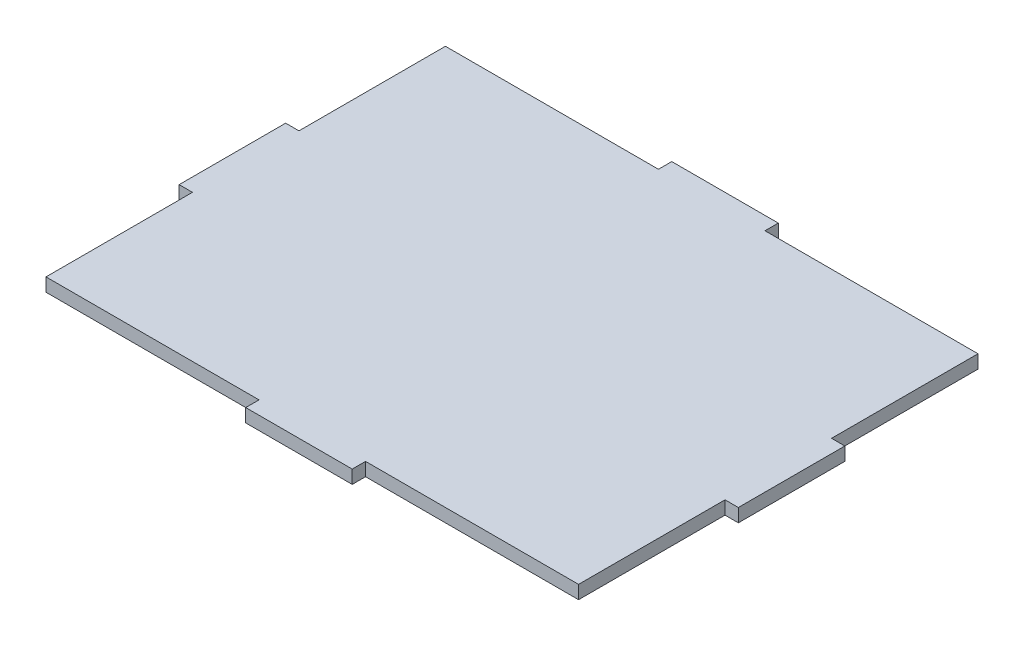
ISO-10303-21;
HEADER;
FILE_DESCRIPTION(('STEP AP214'),'2;1');
FILE_NAME('part.step','',(''),(''),'','','');
FILE_SCHEMA(('AUTOMOTIVE_DESIGN { 1 0 10303 214 1 1 1 1 }'));
ENDSEC;
DATA;
#1=APPLICATION_CONTEXT('core data for automotive mechanical design processes');
#2=APPLICATION_PROTOCOL_DEFINITION('international standard','automotive_design',2000,#1);
#3=PRODUCT_CONTEXT('',#1,'mechanical');
#4=PRODUCT('Part','Part','',(#3));
#5=PRODUCT_RELATED_PRODUCT_CATEGORY('part','',(#4));
#6=PRODUCT_DEFINITION_FORMATION('','',#4);
#7=PRODUCT_DEFINITION_CONTEXT('part definition',#1,'design');
#8=PRODUCT_DEFINITION('design','',#6,#7);
#9=PRODUCT_DEFINITION_SHAPE('','',#8);
#10=(LENGTH_UNIT() NAMED_UNIT(*) SI_UNIT(.MILLI.,.METRE.));
#11=(NAMED_UNIT(*) PLANE_ANGLE_UNIT() SI_UNIT($,.RADIAN.));
#12=(NAMED_UNIT(*) SI_UNIT($,.STERADIAN.) SOLID_ANGLE_UNIT());
#13=UNCERTAINTY_MEASURE_WITH_UNIT(LENGTH_MEASURE(1.E-05),#10,'distance_accuracy_value','');
#14=(GEOMETRIC_REPRESENTATION_CONTEXT(3) GLOBAL_UNCERTAINTY_ASSIGNED_CONTEXT((#13)) GLOBAL_UNIT_ASSIGNED_CONTEXT((#10,
#11,#12)) REPRESENTATION_CONTEXT('',''));
#15=CARTESIAN_POINT('',(0.,0.,0.));
#16=DIRECTION('',(0.,0.,1.));
#17=DIRECTION('',(1.,0.,0.));
#18=AXIS2_PLACEMENT_3D('',#15,#16,#17);
#19=CARTESIAN_POINT('',(0.875862068965519,3.175,44.8879310344828));
#20=DIRECTION('',(0.,0.,-1.));
#21=DIRECTION('',(-1.,0.,0.));
#22=AXIS2_PLACEMENT_3D('',#19,#20,#21);
#23=PLANE('',#22);
#24=DIRECTION('',(0.,-1.,0.));
#25=VECTOR('',#24,1.);
#26=CARTESIAN_POINT('',(51.6758620689655,0.,44.8879310344828));
#27=LINE('',#26,#25);
#28=CARTESIAN_POINT('',(51.6758620689655,3.175,44.8879310344828));
#29=VERTEX_POINT('',#28);
#30=CARTESIAN_POINT('',(51.6758620689655,0.,44.8879310344828));
#31=VERTEX_POINT('',#30);
#32=EDGE_CURVE('E48',#29,#31,#27,.T.);
#33=ORIENTED_EDGE('',*,*,#32,.F.);
#34=DIRECTION('',(1.,0.,0.));
#35=VECTOR('',#34,1.);
#36=CARTESIAN_POINT('',(0.875862068965519,3.175,44.8879310344828));
#37=LINE('',#36,#35);
#38=CARTESIAN_POINT('',(0.875862068965519,3.175,44.8879310344828));
#39=VERTEX_POINT('',#38);
#40=EDGE_CURVE('E286',#39,#29,#37,.T.);
#41=ORIENTED_EDGE('',*,*,#40,.F.);
#42=DIRECTION('',(0.,-1.,0.));
#43=VECTOR('',#42,1.);
#44=CARTESIAN_POINT('',(0.875862068965519,3.175,44.8879310344828));
#45=LINE('',#44,#43);
#46=CARTESIAN_POINT('',(0.875862068965519,0.,44.8879310344828));
#47=VERTEX_POINT('',#46);
#48=EDGE_CURVE('E11',#39,#47,#45,.T.);
#49=ORIENTED_EDGE('',*,*,#48,.T.);
#50=DIRECTION('',(1.,0.,0.));
#51=VECTOR('',#50,1.);
#52=CARTESIAN_POINT('',(0.875862068965519,0.,44.8879310344828));
#53=LINE('',#52,#51);
#54=EDGE_CURVE('E300',#47,#31,#53,.T.);
#55=ORIENTED_EDGE('',*,*,#54,.T.);
#56=EDGE_LOOP('',(#33,#41,#49,#55));
#57=FACE_BOUND('',#56,.T.);
#58=ADVANCED_FACE('F33',(#57),#23,.F.);
#59=DIRECTION('',(0.,1.,0.));
#60=VECTOR('',#59,1.);
#61=CARTESIAN_POINT('',(77.0758620689655,0.,44.8879310344828));
#62=LINE('',#61,#60);
#63=CARTESIAN_POINT('',(77.0758620689655,0.,44.8879310344828));
#64=VERTEX_POINT('',#63);
#65=CARTESIAN_POINT('',(77.0758620689655,3.175,44.8879310344828));
#66=VERTEX_POINT('',#65);
#67=EDGE_CURVE('E56',#64,#66,#62,.T.);
#68=ORIENTED_EDGE('',*,*,#67,.F.);
#69=CARTESIAN_POINT('',(127.875862068966,0.,44.8879310344828));
#70=VERTEX_POINT('',#69);
#71=EDGE_CURVE('E299',#64,#70,#53,.T.);
#72=ORIENTED_EDGE('',*,*,#71,.T.);
#73=DIRECTION('',(0.,-1.,0.));
#74=VECTOR('',#73,1.);
#75=CARTESIAN_POINT('',(127.875862068966,3.175,44.8879310344828));
#76=LINE('',#75,#74);
#77=CARTESIAN_POINT('',(127.875862068966,3.175,44.8879310344828));
#78=VERTEX_POINT('',#77);
#79=EDGE_CURVE('E41',#78,#70,#76,.T.);
#80=ORIENTED_EDGE('',*,*,#79,.F.);
#81=EDGE_CURVE('E284',#66,#78,#37,.T.);
#82=ORIENTED_EDGE('',*,*,#81,.F.);
#83=EDGE_LOOP('',(#68,#72,#80,#82));
#84=FACE_BOUND('',#83,.T.);
#85=ADVANCED_FACE('F329',(#84),#23,.F.);
#86=CARTESIAN_POINT('',(0.875862068965505,3.175,-50.3620689655172));
#87=DIRECTION('',(0.,0.,1.));
#88=DIRECTION('',(1.,0.,0.));
#89=AXIS2_PLACEMENT_3D('',#86,#87,#88);
#90=PLANE('',#89);
#91=DIRECTION('',(0.,1.,0.));
#92=VECTOR('',#91,1.);
#93=CARTESIAN_POINT('',(51.6758620689655,3.175,-50.3620689655172));
#94=LINE('',#93,#92);
#95=CARTESIAN_POINT('',(51.6758620689655,0.,-50.3620689655172));
#96=VERTEX_POINT('',#95);
#97=CARTESIAN_POINT('',(51.6758620689655,3.175,-50.3620689655172));
#98=VERTEX_POINT('',#97);
#99=EDGE_CURVE('E194',#96,#98,#94,.T.);
#100=ORIENTED_EDGE('',*,*,#99,.F.);
#101=DIRECTION('',(-1.,0.,0.));
#102=VECTOR('',#101,1.);
#103=CARTESIAN_POINT('',(0.875862068965505,0.,-50.3620689655172));
#104=LINE('',#103,#102);
#105=CARTESIAN_POINT('',(0.875862068965505,0.,-50.3620689655172));
#106=VERTEX_POINT('',#105);
#107=EDGE_CURVE('E305',#96,#106,#104,.T.);
#108=ORIENTED_EDGE('',*,*,#107,.T.);
#109=DIRECTION('',(0.,-1.,0.));
#110=VECTOR('',#109,1.);
#111=CARTESIAN_POINT('',(0.875862068965505,3.175,-50.3620689655172));
#112=LINE('',#111,#110);
#113=CARTESIAN_POINT('',(0.875862068965505,3.175,-50.3620689655172));
#114=VERTEX_POINT('',#113);
#115=EDGE_CURVE('E296',#114,#106,#112,.T.);
#116=ORIENTED_EDGE('',*,*,#115,.F.);
#117=DIRECTION('',(-1.,0.,0.));
#118=VECTOR('',#117,1.);
#119=CARTESIAN_POINT('',(0.875862068965505,3.175,-50.3620689655172));
#120=LINE('',#119,#118);
#121=EDGE_CURVE('E292',#98,#114,#120,.T.);
#122=ORIENTED_EDGE('',*,*,#121,.F.);
#123=EDGE_LOOP('',(#100,#108,#116,#122));
#124=FACE_BOUND('',#123,.T.);
#125=ADVANCED_FACE('F361',(#124),#90,.F.);
#126=DIRECTION('',(0.,-1.,0.));
#127=VECTOR('',#126,1.);
#128=CARTESIAN_POINT('',(77.0758620689655,3.175,-50.3620689655172));
#129=LINE('',#128,#127);
#130=CARTESIAN_POINT('',(77.0758620689655,3.175,-50.3620689655172));
#131=VERTEX_POINT('',#130);
#132=CARTESIAN_POINT('',(77.0758620689655,0.,-50.3620689655172));
#133=VERTEX_POINT('',#132);
#134=EDGE_CURVE('E197',#131,#133,#129,.T.);
#135=ORIENTED_EDGE('',*,*,#134,.F.);
#136=CARTESIAN_POINT('',(127.875862068966,3.175,-50.3620689655172));
#137=VERTEX_POINT('',#136);
#138=EDGE_CURVE('E293',#137,#131,#120,.T.);
#139=ORIENTED_EDGE('',*,*,#138,.F.);
#140=DIRECTION('',(0.,-1.,0.));
#141=VECTOR('',#140,1.);
#142=CARTESIAN_POINT('',(127.875862068966,3.175,-50.3620689655172));
#143=LINE('',#142,#141);
#144=CARTESIAN_POINT('',(127.875862068966,0.,-50.3620689655172));
#145=VERTEX_POINT('',#144);
#146=EDGE_CURVE('E310',#137,#145,#143,.T.);
#147=ORIENTED_EDGE('',*,*,#146,.T.);
#148=EDGE_CURVE('E306',#145,#133,#104,.T.);
#149=ORIENTED_EDGE('',*,*,#148,.T.);
#150=EDGE_LOOP('',(#135,#139,#147,#149));
#151=FACE_BOUND('',#150,.T.);
#152=ADVANCED_FACE('F378',(#151),#90,.F.);
#153=CARTESIAN_POINT('',(0.875862068965505,3.175,-50.3620689655172));
#154=DIRECTION('',(1.,0.,0.));
#155=DIRECTION('',(0.,0.,-1.));
#156=AXIS2_PLACEMENT_3D('',#153,#154,#155);
#157=PLANE('',#156);
#158=DIRECTION('',(0.,1.,0.));
#159=VECTOR('',#158,1.);
#160=CARTESIAN_POINT('',(0.875862068965514,3.175,9.96293103448278));
#161=LINE('',#160,#159);
#162=CARTESIAN_POINT('',(0.875862068965514,0.,9.96293103448278));
#163=VERTEX_POINT('',#162);
#164=CARTESIAN_POINT('',(0.875862068965514,3.175,9.96293103448278));
#165=VERTEX_POINT('',#164);
#166=EDGE_CURVE('E226',#163,#165,#161,.T.);
#167=ORIENTED_EDGE('',*,*,#166,.F.);
#168=DIRECTION('',(0.,0.,1.));
#169=VECTOR('',#168,1.);
#170=CARTESIAN_POINT('',(0.875862068965505,0.,-50.3620689655172));
#171=LINE('',#170,#169);
#172=EDGE_CURVE('E280',#163,#47,#171,.T.);
#173=ORIENTED_EDGE('',*,*,#172,.T.);
#174=ORIENTED_EDGE('',*,*,#48,.F.);
#175=DIRECTION('',(0.,0.,1.));
#176=VECTOR('',#175,1.);
#177=CARTESIAN_POINT('',(0.875862068965505,3.175,-50.3620689655172));
#178=LINE('',#177,#176);
#179=EDGE_CURVE('E285',#165,#39,#178,.T.);
#180=ORIENTED_EDGE('',*,*,#179,.F.);
#181=EDGE_LOOP('',(#167,#173,#174,#180));
#182=FACE_BOUND('',#181,.T.);
#183=ADVANCED_FACE('F35',(#182),#157,.F.);
#184=DIRECTION('',(0.,-1.,0.));
#185=VECTOR('',#184,1.);
#186=CARTESIAN_POINT('',(0.87586206896551,3.175,-15.4370689655172));
#187=LINE('',#186,#185);
#188=CARTESIAN_POINT('',(0.87586206896551,3.175,-15.4370689655172));
#189=VERTEX_POINT('',#188);
#190=CARTESIAN_POINT('',(0.87586206896551,0.,-15.4370689655172));
#191=VERTEX_POINT('',#190);
#192=EDGE_CURVE('E231',#189,#191,#187,.T.);
#193=ORIENTED_EDGE('',*,*,#192,.F.);
#194=EDGE_CURVE('E281',#114,#189,#178,.T.);
#195=ORIENTED_EDGE('',*,*,#194,.F.);
#196=ORIENTED_EDGE('',*,*,#115,.T.);
#197=EDGE_CURVE('E297',#106,#191,#171,.T.);
#198=ORIENTED_EDGE('',*,*,#197,.T.);
#199=EDGE_LOOP('',(#193,#195,#196,#198));
#200=FACE_BOUND('',#199,.T.);
#201=ADVANCED_FACE('F357',(#200),#157,.F.);
#202=CARTESIAN_POINT('',(127.875862068966,3.175,-50.3620689655172));
#203=DIRECTION('',(-1.,0.,0.));
#204=DIRECTION('',(0.,0.,1.));
#205=AXIS2_PLACEMENT_3D('',#202,#203,#204);
#206=PLANE('',#205);
#207=DIRECTION('',(0.,-1.,0.));
#208=VECTOR('',#207,1.);
#209=CARTESIAN_POINT('',(127.875862068966,3.175,9.96293103448276));
#210=LINE('',#209,#208);
#211=CARTESIAN_POINT('',(127.875862068966,3.175,9.96293103448276));
#212=VERTEX_POINT('',#211);
#213=CARTESIAN_POINT('',(127.875862068966,0.,9.96293103448276));
#214=VERTEX_POINT('',#213);
#215=EDGE_CURVE('E253',#212,#214,#210,.T.);
#216=ORIENTED_EDGE('',*,*,#215,.F.);
#217=DIRECTION('',(0.,0.,-1.));
#218=VECTOR('',#217,1.);
#219=CARTESIAN_POINT('',(127.875862068966,3.175,-50.3620689655172));
#220=LINE('',#219,#218);
#221=EDGE_CURVE('E289',#78,#212,#220,.T.);
#222=ORIENTED_EDGE('',*,*,#221,.F.);
#223=ORIENTED_EDGE('',*,*,#79,.T.);
#224=DIRECTION('',(0.,0.,-1.));
#225=VECTOR('',#224,1.);
#226=CARTESIAN_POINT('',(127.875862068966,0.,-50.3620689655172));
#227=LINE('',#226,#225);
#228=EDGE_CURVE('E303',#70,#214,#227,.T.);
#229=ORIENTED_EDGE('',*,*,#228,.T.);
#230=EDGE_LOOP('',(#216,#222,#223,#229));
#231=FACE_BOUND('',#230,.T.);
#232=ADVANCED_FACE('F317',(#231),#206,.F.);
#233=DIRECTION('',(0.,1.,0.));
#234=VECTOR('',#233,1.);
#235=CARTESIAN_POINT('',(127.875862068966,3.175,-15.4370689655172));
#236=LINE('',#235,#234);
#237=CARTESIAN_POINT('',(127.875862068966,0.,-15.4370689655172));
#238=VERTEX_POINT('',#237);
#239=CARTESIAN_POINT('',(127.875862068966,3.175,-15.4370689655172));
#240=VERTEX_POINT('',#239);
#241=EDGE_CURVE('E258',#238,#240,#236,.T.);
#242=ORIENTED_EDGE('',*,*,#241,.F.);
#243=EDGE_CURVE('E302',#238,#145,#227,.T.);
#244=ORIENTED_EDGE('',*,*,#243,.T.);
#245=ORIENTED_EDGE('',*,*,#146,.F.);
#246=EDGE_CURVE('E288',#240,#137,#220,.T.);
#247=ORIENTED_EDGE('',*,*,#246,.F.);
#248=EDGE_LOOP('',(#242,#244,#245,#247));
#249=FACE_BOUND('',#248,.T.);
#250=ADVANCED_FACE('F382',(#249),#206,.F.);
#251=CARTESIAN_POINT('',(0.,3.175,0.));
#252=DIRECTION('',(0.,1.,0.));
#253=DIRECTION('',(0.,0.,1.));
#254=AXIS2_PLACEMENT_3D('',#251,#252,#253);
#255=PLANE('',#254);
#256=ORIENTED_EDGE('',*,*,#194,.T.);
#257=DIRECTION('',(1.,0.,0.));
#258=VECTOR('',#257,1.);
#259=CARTESIAN_POINT('',(-2.29913793103449,3.175,-15.4370689655172));
#260=LINE('',#259,#258);
#261=CARTESIAN_POINT('',(-2.29913793103449,3.175,-15.4370689655172));
#262=VERTEX_POINT('',#261);
#263=EDGE_CURVE('E247',#262,#189,#260,.T.);
#264=ORIENTED_EDGE('',*,*,#263,.F.);
#265=DIRECTION('',(0.,0.,-1.));
#266=VECTOR('',#265,1.);
#267=CARTESIAN_POINT('',(-2.29913793103449,3.175,9.96293103448278));
#268=LINE('',#267,#266);
#269=CARTESIAN_POINT('',(-2.29913793103449,3.175,9.96293103448278));
#270=VERTEX_POINT('',#269);
#271=EDGE_CURVE('E230',#270,#262,#268,.T.);
#272=ORIENTED_EDGE('',*,*,#271,.F.);
#273=DIRECTION('',(1.,0.,0.));
#274=VECTOR('',#273,1.);
#275=CARTESIAN_POINT('',(-2.29913793103449,3.175,9.96293103448278));
#276=LINE('',#275,#274);
#277=EDGE_CURVE('E250',#270,#165,#276,.T.);
#278=ORIENTED_EDGE('',*,*,#277,.T.);
#279=ORIENTED_EDGE('',*,*,#179,.T.);
#280=ORIENTED_EDGE('',*,*,#40,.T.);
#281=DIRECTION('',(0.,0.,-1.));
#282=VECTOR('',#281,1.);
#283=CARTESIAN_POINT('',(51.6758620689655,3.175,48.0629310344828));
#284=LINE('',#283,#282);
#285=CARTESIAN_POINT('',(51.6758620689655,3.175,48.0629310344828));
#286=VERTEX_POINT('',#285);
#287=EDGE_CURVE('E336',#286,#29,#284,.T.);
#288=ORIENTED_EDGE('',*,*,#287,.F.);
#289=DIRECTION('',(-1.,0.,0.));
#290=VECTOR('',#289,1.);
#291=CARTESIAN_POINT('',(51.6758620689655,3.175,48.0629310344828));
#292=LINE('',#291,#290);
#293=CARTESIAN_POINT('',(77.0758620689655,3.175,48.0629310344828));
#294=VERTEX_POINT('',#293);
#295=EDGE_CURVE('E188',#294,#286,#292,.T.);
#296=ORIENTED_EDGE('',*,*,#295,.F.);
#297=DIRECTION('',(0.,0.,-1.));
#298=VECTOR('',#297,1.);
#299=CARTESIAN_POINT('',(77.0758620689655,3.175,48.0629310344828));
#300=LINE('',#299,#298);
#301=EDGE_CURVE('E199',#294,#66,#300,.T.);
#302=ORIENTED_EDGE('',*,*,#301,.T.);
#303=ORIENTED_EDGE('',*,*,#81,.T.);
#304=ORIENTED_EDGE('',*,*,#221,.T.);
#305=DIRECTION('',(-1.,0.,0.));
#306=VECTOR('',#305,1.);
#307=CARTESIAN_POINT('',(131.050862068966,3.175,9.96293103448276));
#308=LINE('',#307,#306);
#309=CARTESIAN_POINT('',(131.050862068966,3.175,9.96293103448276));
#310=VERTEX_POINT('',#309);
#311=EDGE_CURVE('E264',#310,#212,#308,.T.);
#312=ORIENTED_EDGE('',*,*,#311,.F.);
#313=DIRECTION('',(0.,0.,1.));
#314=VECTOR('',#313,1.);
#315=CARTESIAN_POINT('',(131.050862068966,3.175,9.96293103448276));
#316=LINE('',#315,#314);
#317=CARTESIAN_POINT('',(131.050862068966,3.175,-15.4370689655172));
#318=VERTEX_POINT('',#317);
#319=EDGE_CURVE('E262',#318,#310,#316,.T.);
#320=ORIENTED_EDGE('',*,*,#319,.F.);
#321=DIRECTION('',(-1.,0.,0.));
#322=VECTOR('',#321,1.);
#323=CARTESIAN_POINT('',(131.050862068966,3.175,-15.4370689655172));
#324=LINE('',#323,#322);
#325=EDGE_CURVE('E271',#318,#240,#324,.T.);
#326=ORIENTED_EDGE('',*,*,#325,.T.);
#327=ORIENTED_EDGE('',*,*,#246,.T.);
#328=ORIENTED_EDGE('',*,*,#138,.T.);
#329=DIRECTION('',(0.,0.,1.));
#330=VECTOR('',#329,1.);
#331=CARTESIAN_POINT('',(77.0758620689655,3.175,-53.5370689655172));
#332=LINE('',#331,#330);
#333=CARTESIAN_POINT('',(77.0758620689655,3.175,-53.5370689655172));
#334=VERTEX_POINT('',#333);
#335=EDGE_CURVE('E220',#334,#131,#332,.T.);
#336=ORIENTED_EDGE('',*,*,#335,.F.);
#337=DIRECTION('',(1.,0.,0.));
#338=VECTOR('',#337,1.);
#339=CARTESIAN_POINT('',(51.6758620689655,3.175,-53.5370689655172));
#340=LINE('',#339,#338);
#341=CARTESIAN_POINT('',(51.6758620689655,3.175,-53.5370689655172));
#342=VERTEX_POINT('',#341);
#343=EDGE_CURVE('E206',#342,#334,#340,.T.);
#344=ORIENTED_EDGE('',*,*,#343,.F.);
#345=DIRECTION('',(0.,0.,1.));
#346=VECTOR('',#345,1.);
#347=CARTESIAN_POINT('',(51.6758620689655,3.175,-53.5370689655172));
#348=LINE('',#347,#346);
#349=EDGE_CURVE('E223',#342,#98,#348,.T.);
#350=ORIENTED_EDGE('',*,*,#349,.T.);
#351=ORIENTED_EDGE('',*,*,#121,.T.);
#352=EDGE_LOOP('',(#256,#264,#272,#278,#279,#280,#288,#296,#302,#303,#304,#312,#320,#326,#327,
#328,#336,#344,#350,#351));
#353=FACE_BOUND('',#352,.T.);
#354=ADVANCED_FACE('F325',(#353),#255,.T.);
#355=CARTESIAN_POINT('',(0.,0.,0.));
#356=DIRECTION('',(0.,1.,0.));
#357=DIRECTION('',(0.,0.,1.));
#358=AXIS2_PLACEMENT_3D('',#355,#356,#357);
#359=PLANE('',#358);
#360=ORIENTED_EDGE('',*,*,#197,.F.);
#361=ORIENTED_EDGE('',*,*,#107,.F.);
#362=DIRECTION('',(0.,0.,1.));
#363=VECTOR('',#362,1.);
#364=CARTESIAN_POINT('',(51.6758620689655,0.,-53.5370689655172));
#365=LINE('',#364,#363);
#366=CARTESIAN_POINT('',(51.6758620689655,0.,-53.5370689655172));
#367=VERTEX_POINT('',#366);
#368=EDGE_CURVE('E211',#367,#96,#365,.T.);
#369=ORIENTED_EDGE('',*,*,#368,.F.);
#370=DIRECTION('',(-1.,0.,0.));
#371=VECTOR('',#370,1.);
#372=CARTESIAN_POINT('',(51.6758620689655,0.,-53.5370689655172));
#373=LINE('',#372,#371);
#374=CARTESIAN_POINT('',(77.0758620689655,0.,-53.5370689655172));
#375=VERTEX_POINT('',#374);
#376=EDGE_CURVE('E210',#375,#367,#373,.T.);
#377=ORIENTED_EDGE('',*,*,#376,.F.);
#378=DIRECTION('',(0.,0.,1.));
#379=VECTOR('',#378,1.);
#380=CARTESIAN_POINT('',(77.0758620689655,0.,-53.5370689655172));
#381=LINE('',#380,#379);
#382=EDGE_CURVE('E217',#375,#133,#381,.T.);
#383=ORIENTED_EDGE('',*,*,#382,.T.);
#384=ORIENTED_EDGE('',*,*,#148,.F.);
#385=ORIENTED_EDGE('',*,*,#243,.F.);
#386=DIRECTION('',(-1.,0.,0.));
#387=VECTOR('',#386,1.);
#388=CARTESIAN_POINT('',(131.050862068966,0.,-15.4370689655172));
#389=LINE('',#388,#387);
#390=CARTESIAN_POINT('',(131.050862068966,0.,-15.4370689655172));
#391=VERTEX_POINT('',#390);
#392=EDGE_CURVE('E274',#391,#238,#389,.T.);
#393=ORIENTED_EDGE('',*,*,#392,.F.);
#394=DIRECTION('',(0.,0.,-1.));
#395=VECTOR('',#394,1.);
#396=CARTESIAN_POINT('',(131.050862068966,0.,9.96293103448276));
#397=LINE('',#396,#395);
#398=CARTESIAN_POINT('',(131.050862068966,0.,9.96293103448276));
#399=VERTEX_POINT('',#398);
#400=EDGE_CURVE('E257',#399,#391,#397,.T.);
#401=ORIENTED_EDGE('',*,*,#400,.F.);
#402=DIRECTION('',(-1.,0.,0.));
#403=VECTOR('',#402,1.);
#404=CARTESIAN_POINT('',(131.050862068966,0.,9.96293103448276));
#405=LINE('',#404,#403);
#406=EDGE_CURVE('E277',#399,#214,#405,.T.);
#407=ORIENTED_EDGE('',*,*,#406,.T.);
#408=ORIENTED_EDGE('',*,*,#228,.F.);
#409=ORIENTED_EDGE('',*,*,#71,.F.);
#410=DIRECTION('',(0.,0.,-1.));
#411=VECTOR('',#410,1.);
#412=CARTESIAN_POINT('',(77.0758620689655,0.,48.0629310344828));
#413=LINE('',#412,#411);
#414=CARTESIAN_POINT('',(77.0758620689655,0.,48.0629310344828));
#415=VERTEX_POINT('',#414);
#416=EDGE_CURVE('E179',#415,#64,#413,.T.);
#417=ORIENTED_EDGE('',*,*,#416,.F.);
#418=DIRECTION('',(1.,0.,0.));
#419=VECTOR('',#418,1.);
#420=CARTESIAN_POINT('',(51.6758620689655,0.,48.0629310344828));
#421=LINE('',#420,#419);
#422=CARTESIAN_POINT('',(51.6758620689655,0.,48.0629310344828));
#423=VERTEX_POINT('',#422);
#424=EDGE_CURVE('E171',#423,#415,#421,.T.);
#425=ORIENTED_EDGE('',*,*,#424,.F.);
#426=DIRECTION('',(0.,0.,-1.));
#427=VECTOR('',#426,1.);
#428=CARTESIAN_POINT('',(51.6758620689655,0.,48.0629310344828));
#429=LINE('',#428,#427);
#430=EDGE_CURVE('E177',#423,#31,#429,.T.);
#431=ORIENTED_EDGE('',*,*,#430,.T.);
#432=ORIENTED_EDGE('',*,*,#54,.F.);
#433=ORIENTED_EDGE('',*,*,#172,.F.);
#434=DIRECTION('',(1.,0.,0.));
#435=VECTOR('',#434,1.);
#436=CARTESIAN_POINT('',(-2.29913793103449,0.,9.96293103448278));
#437=LINE('',#436,#435);
#438=CARTESIAN_POINT('',(-2.29913793103449,0.,9.96293103448278));
#439=VERTEX_POINT('',#438);
#440=EDGE_CURVE('E237',#439,#163,#437,.T.);
#441=ORIENTED_EDGE('',*,*,#440,.F.);
#442=DIRECTION('',(0.,0.,1.));
#443=VECTOR('',#442,1.);
#444=CARTESIAN_POINT('',(-2.29913793103449,0.,9.96293103448278));
#445=LINE('',#444,#443);
#446=CARTESIAN_POINT('',(-2.29913793103449,0.,-15.4370689655172));
#447=VERTEX_POINT('',#446);
#448=EDGE_CURVE('E235',#447,#439,#445,.T.);
#449=ORIENTED_EDGE('',*,*,#448,.F.);
#450=DIRECTION('',(1.,0.,0.));
#451=VECTOR('',#450,1.);
#452=CARTESIAN_POINT('',(-2.29913793103449,0.,-15.4370689655172));
#453=LINE('',#452,#451);
#454=EDGE_CURVE('E244',#447,#191,#453,.T.);
#455=ORIENTED_EDGE('',*,*,#454,.T.);
#456=EDGE_LOOP('',(#360,#361,#369,#377,#383,#384,#385,#393,#401,#407,#408,#409,#417,#425,#431,
#432,#433,#441,#449,#455));
#457=FACE_BOUND('',#456,.T.);
#458=ADVANCED_FACE('F174',(#457),#359,.F.);
#459=CARTESIAN_POINT('',(131.050862068966,3.175,9.96293103448276));
#460=DIRECTION('',(0.,0.,-1.));
#461=DIRECTION('',(-1.,0.,0.));
#462=AXIS2_PLACEMENT_3D('',#459,#460,#461);
#463=PLANE('',#462);
#464=ORIENTED_EDGE('',*,*,#215,.T.);
#465=ORIENTED_EDGE('',*,*,#406,.F.);
#466=DIRECTION('',(0.,-1.,0.));
#467=VECTOR('',#466,1.);
#468=CARTESIAN_POINT('',(131.050862068966,3.175,9.96293103448276));
#469=LINE('',#468,#467);
#470=EDGE_CURVE('E254',#310,#399,#469,.T.);
#471=ORIENTED_EDGE('',*,*,#470,.F.);
#472=ORIENTED_EDGE('',*,*,#311,.T.);
#473=EDGE_LOOP('',(#464,#465,#471,#472));
#474=FACE_BOUND('',#473,.T.);
#475=ADVANCED_FACE('F322',(#474),#463,.F.);
#476=CARTESIAN_POINT('',(131.050862068966,3.175,-15.4370689655172));
#477=DIRECTION('',(0.,0.,1.));
#478=DIRECTION('',(1.,0.,0.));
#479=AXIS2_PLACEMENT_3D('',#476,#477,#478);
#480=PLANE('',#479);
#481=ORIENTED_EDGE('',*,*,#241,.T.);
#482=ORIENTED_EDGE('',*,*,#325,.F.);
#483=DIRECTION('',(0.,1.,0.));
#484=VECTOR('',#483,1.);
#485=CARTESIAN_POINT('',(131.050862068966,3.175,-15.4370689655172));
#486=LINE('',#485,#484);
#487=EDGE_CURVE('E260',#391,#318,#486,.T.);
#488=ORIENTED_EDGE('',*,*,#487,.F.);
#489=ORIENTED_EDGE('',*,*,#392,.T.);
#490=EDGE_LOOP('',(#481,#482,#488,#489));
#491=FACE_BOUND('',#490,.T.);
#492=ADVANCED_FACE('F385',(#491),#480,.F.);
#493=CARTESIAN_POINT('',(131.050862068966,0.,0.));
#494=DIRECTION('',(1.,0.,0.));
#495=DIRECTION('',(0.,0.,-1.));
#496=AXIS2_PLACEMENT_3D('',#493,#494,#495);
#497=PLANE('',#496);
#498=ORIENTED_EDGE('',*,*,#470,.T.);
#499=ORIENTED_EDGE('',*,*,#400,.T.);
#500=ORIENTED_EDGE('',*,*,#487,.T.);
#501=ORIENTED_EDGE('',*,*,#319,.T.);
#502=EDGE_LOOP('',(#498,#499,#500,#501));
#503=FACE_BOUND('',#502,.T.);
#504=ADVANCED_FACE('F387',(#503),#497,.T.);
#505=CARTESIAN_POINT('',(-2.29913793103449,3.175,9.96293103448278));
#506=DIRECTION('',(0.,0.,-1.));
#507=DIRECTION('',(-1.,0.,0.));
#508=AXIS2_PLACEMENT_3D('',#505,#506,#507);
#509=PLANE('',#508);
#510=ORIENTED_EDGE('',*,*,#166,.T.);
#511=ORIENTED_EDGE('',*,*,#277,.F.);
#512=DIRECTION('',(0.,1.,0.));
#513=VECTOR('',#512,1.);
#514=CARTESIAN_POINT('',(-2.29913793103449,3.175,9.96293103448278));
#515=LINE('',#514,#513);
#516=EDGE_CURVE('E227',#439,#270,#515,.T.);
#517=ORIENTED_EDGE('',*,*,#516,.F.);
#518=ORIENTED_EDGE('',*,*,#440,.T.);
#519=EDGE_LOOP('',(#510,#511,#517,#518));
#520=FACE_BOUND('',#519,.T.);
#521=ADVANCED_FACE('F345',(#520),#509,.F.);
#522=CARTESIAN_POINT('',(-2.29913793103449,3.175,-15.4370689655172));
#523=DIRECTION('',(0.,0.,1.));
#524=DIRECTION('',(1.,0.,0.));
#525=AXIS2_PLACEMENT_3D('',#522,#523,#524);
#526=PLANE('',#525);
#527=ORIENTED_EDGE('',*,*,#192,.T.);
#528=ORIENTED_EDGE('',*,*,#454,.F.);
#529=DIRECTION('',(0.,-1.,0.));
#530=VECTOR('',#529,1.);
#531=CARTESIAN_POINT('',(-2.29913793103449,3.175,-15.4370689655172));
#532=LINE('',#531,#530);
#533=EDGE_CURVE('E233',#262,#447,#532,.T.);
#534=ORIENTED_EDGE('',*,*,#533,.F.);
#535=ORIENTED_EDGE('',*,*,#263,.T.);
#536=EDGE_LOOP('',(#527,#528,#534,#535));
#537=FACE_BOUND('',#536,.T.);
#538=ADVANCED_FACE('F354',(#537),#526,.F.);
#539=CARTESIAN_POINT('',(-2.29913793103449,0.,0.));
#540=DIRECTION('',(1.,0.,0.));
#541=DIRECTION('',(0.,0.,-1.));
#542=AXIS2_PLACEMENT_3D('',#539,#540,#541);
#543=PLANE('',#542);
#544=ORIENTED_EDGE('',*,*,#516,.T.);
#545=ORIENTED_EDGE('',*,*,#271,.T.);
#546=ORIENTED_EDGE('',*,*,#533,.T.);
#547=ORIENTED_EDGE('',*,*,#448,.T.);
#548=EDGE_LOOP('',(#544,#545,#546,#547));
#549=FACE_BOUND('',#548,.T.);
#550=ADVANCED_FACE('F348',(#549),#543,.F.);
#551=CARTESIAN_POINT('',(51.6758620689655,3.175,-53.5370689655172));
#552=DIRECTION('',(1.,0.,0.));
#553=DIRECTION('',(0.,1.,0.));
#554=AXIS2_PLACEMENT_3D('',#551,#552,#553);
#555=PLANE('',#554);
#556=ORIENTED_EDGE('',*,*,#99,.T.);
#557=ORIENTED_EDGE('',*,*,#349,.F.);
#558=DIRECTION('',(0.,1.,0.));
#559=VECTOR('',#558,1.);
#560=CARTESIAN_POINT('',(51.6758620689655,3.175,-53.5370689655172));
#561=LINE('',#560,#559);
#562=EDGE_CURVE('E203',#367,#342,#561,.T.);
#563=ORIENTED_EDGE('',*,*,#562,.F.);
#564=ORIENTED_EDGE('',*,*,#368,.T.);
#565=EDGE_LOOP('',(#556,#557,#563,#564));
#566=FACE_BOUND('',#565,.T.);
#567=ADVANCED_FACE('F366',(#566),#555,.F.);
#568=CARTESIAN_POINT('',(77.0758620689655,3.175,-53.5370689655172));
#569=DIRECTION('',(-1.,0.,0.));
#570=DIRECTION('',(0.,0.,1.));
#571=AXIS2_PLACEMENT_3D('',#568,#569,#570);
#572=PLANE('',#571);
#573=ORIENTED_EDGE('',*,*,#134,.T.);
#574=ORIENTED_EDGE('',*,*,#382,.F.);
#575=DIRECTION('',(0.,-1.,0.));
#576=VECTOR('',#575,1.);
#577=CARTESIAN_POINT('',(77.0758620689655,3.175,-53.5370689655172));
#578=LINE('',#577,#576);
#579=EDGE_CURVE('E208',#334,#375,#578,.T.);
#580=ORIENTED_EDGE('',*,*,#579,.F.);
#581=ORIENTED_EDGE('',*,*,#335,.T.);
#582=EDGE_LOOP('',(#573,#574,#580,#581));
#583=FACE_BOUND('',#582,.T.);
#584=ADVANCED_FACE('F375',(#583),#572,.F.);
#585=CARTESIAN_POINT('',(0.,0.,-53.5370689655172));
#586=DIRECTION('',(0.,0.,1.));
#587=DIRECTION('',(1.,0.,0.));
#588=AXIS2_PLACEMENT_3D('',#585,#586,#587);
#589=PLANE('',#588);
#590=ORIENTED_EDGE('',*,*,#562,.T.);
#591=ORIENTED_EDGE('',*,*,#343,.T.);
#592=ORIENTED_EDGE('',*,*,#579,.T.);
#593=ORIENTED_EDGE('',*,*,#376,.T.);
#594=EDGE_LOOP('',(#590,#591,#592,#593));
#595=FACE_BOUND('',#594,.T.);
#596=ADVANCED_FACE('F368',(#595),#589,.F.);
#597=CARTESIAN_POINT('',(51.6758620689655,0.,48.0629310344828));
#598=DIRECTION('',(1.,0.,0.));
#599=DIRECTION('',(0.,0.,-1.));
#600=AXIS2_PLACEMENT_3D('',#597,#598,#599);
#601=PLANE('',#600);
#602=ORIENTED_EDGE('',*,*,#32,.T.);
#603=ORIENTED_EDGE('',*,*,#430,.F.);
#604=DIRECTION('',(0.,-1.,0.));
#605=VECTOR('',#604,1.);
#606=CARTESIAN_POINT('',(51.6758620689655,0.,48.0629310344828));
#607=LINE('',#606,#605);
#608=EDGE_CURVE('E183',#286,#423,#607,.T.);
#609=ORIENTED_EDGE('',*,*,#608,.F.);
#610=ORIENTED_EDGE('',*,*,#287,.T.);
#611=EDGE_LOOP('',(#602,#603,#609,#610));
#612=FACE_BOUND('',#611,.T.);
#613=ADVANCED_FACE('F193',(#612),#601,.F.);
#614=CARTESIAN_POINT('',(77.0758620689655,0.,48.0629310344828));
#615=DIRECTION('',(-1.,0.,0.));
#616=DIRECTION('',(0.,0.,1.));
#617=AXIS2_PLACEMENT_3D('',#614,#615,#616);
#618=PLANE('',#617);
#619=ORIENTED_EDGE('',*,*,#67,.T.);
#620=ORIENTED_EDGE('',*,*,#301,.F.);
#621=DIRECTION('',(0.,1.,0.));
#622=VECTOR('',#621,1.);
#623=CARTESIAN_POINT('',(77.0758620689655,0.,48.0629310344828));
#624=LINE('',#623,#622);
#625=EDGE_CURVE('E182',#415,#294,#624,.T.);
#626=ORIENTED_EDGE('',*,*,#625,.F.);
#627=ORIENTED_EDGE('',*,*,#416,.T.);
#628=EDGE_LOOP('',(#619,#620,#626,#627));
#629=FACE_BOUND('',#628,.T.);
#630=ADVANCED_FACE('F331',(#629),#618,.F.);
#631=CARTESIAN_POINT('',(0.,0.,48.0629310344828));
#632=DIRECTION('',(0.,0.,-1.));
#633=DIRECTION('',(-1.,0.,0.));
#634=AXIS2_PLACEMENT_3D('',#631,#632,#633);
#635=PLANE('',#634);
#636=ORIENTED_EDGE('',*,*,#608,.T.);
#637=ORIENTED_EDGE('',*,*,#424,.T.);
#638=ORIENTED_EDGE('',*,*,#625,.T.);
#639=ORIENTED_EDGE('',*,*,#295,.T.);
#640=EDGE_LOOP('',(#636,#637,#638,#639));
#641=FACE_BOUND('',#640,.T.);
#642=ADVANCED_FACE('F186',(#641),#635,.F.);
#643=CLOSED_SHELL('',(#58,#85,#125,#152,#183,#201,#232,#250,#354,#458,#475,#492,#504,#521,#538,
#550,#567,#584,#596,#613,#630,#642));
#644=MANIFOLD_SOLID_BREP('B2',#643);
#645=ADVANCED_BREP_SHAPE_REPRESENTATION('',(#18,#644),#14);
#646=SHAPE_DEFINITION_REPRESENTATION(#9,#645);
ENDSEC;
END-ISO-10303-21;
